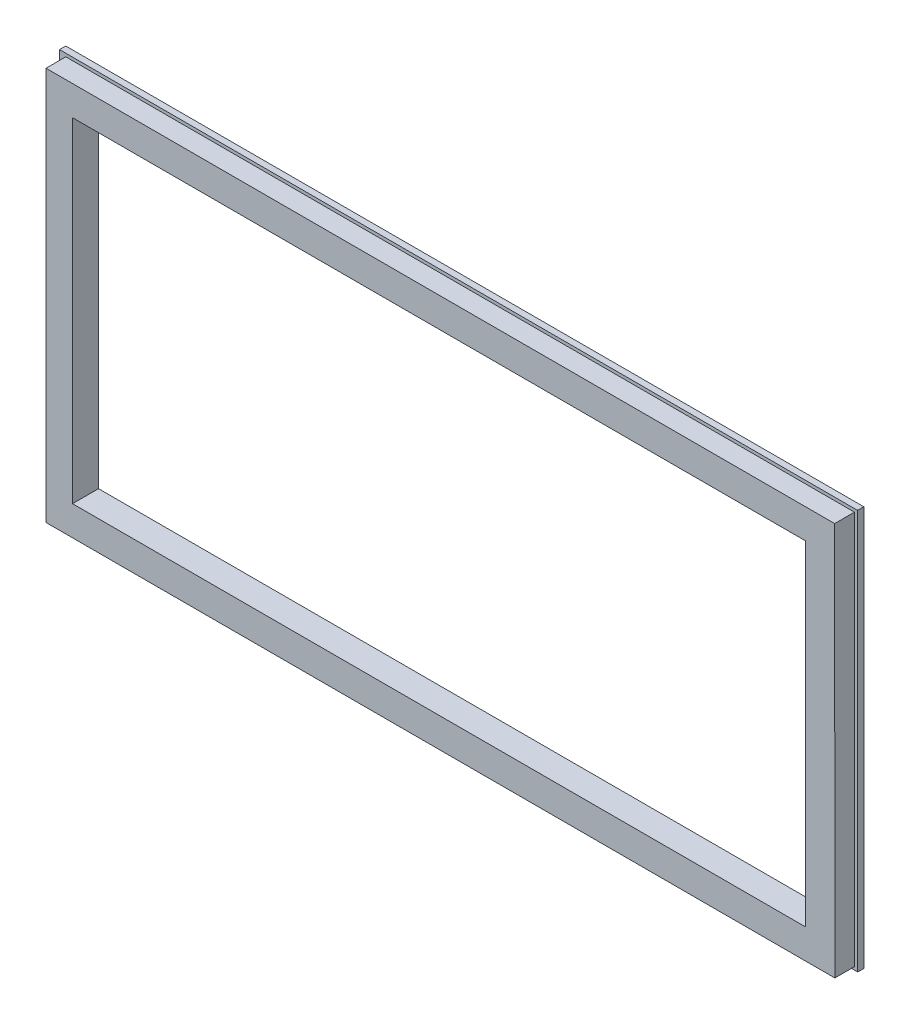
ISO-10303-21;
HEADER;
FILE_DESCRIPTION(('STEP AP214'),'2;1');
FILE_NAME('part.step','',(''),(''),'','','');
FILE_SCHEMA(('AUTOMOTIVE_DESIGN { 1 0 10303 214 1 1 1 1 }'));
ENDSEC;
DATA;
#1=APPLICATION_CONTEXT('core data for automotive mechanical design processes');
#2=APPLICATION_PROTOCOL_DEFINITION('international standard','automotive_design',2000,#1);
#3=PRODUCT_CONTEXT('',#1,'mechanical');
#4=PRODUCT('Part','Part','',(#3));
#5=PRODUCT_RELATED_PRODUCT_CATEGORY('part','',(#4));
#6=PRODUCT_DEFINITION_FORMATION('','',#4);
#7=PRODUCT_DEFINITION_CONTEXT('part definition',#1,'design');
#8=PRODUCT_DEFINITION('design','',#6,#7);
#9=PRODUCT_DEFINITION_SHAPE('','',#8);
#10=(LENGTH_UNIT() NAMED_UNIT(*) SI_UNIT(.MILLI.,.METRE.));
#11=(NAMED_UNIT(*) PLANE_ANGLE_UNIT() SI_UNIT($,.RADIAN.));
#12=(NAMED_UNIT(*) SI_UNIT($,.STERADIAN.) SOLID_ANGLE_UNIT());
#13=UNCERTAINTY_MEASURE_WITH_UNIT(LENGTH_MEASURE(1.E-05),#10,'distance_accuracy_value','');
#14=(GEOMETRIC_REPRESENTATION_CONTEXT(3) GLOBAL_UNCERTAINTY_ASSIGNED_CONTEXT((#13)) GLOBAL_UNIT_ASSIGNED_CONTEXT((#10,
#11,#12)) REPRESENTATION_CONTEXT('',''));
#15=CARTESIAN_POINT('',(0.,0.,0.));
#16=DIRECTION('',(0.,0.,1.));
#17=DIRECTION('',(1.,0.,0.));
#18=AXIS2_PLACEMENT_3D('',#15,#16,#17);
#19=CARTESIAN_POINT('',(-4.90493030607165,-7.72631975662474,3.));
#20=DIRECTION('',(0.99999998742194,0.000158606807848639,0.));
#21=DIRECTION('',(-0.000158606807848639,0.99999998742194,0.));
#22=AXIS2_PLACEMENT_3D('',#19,#20,#21);
#23=PLANE('',#22);
#24=DIRECTION('',(0.000158606807848639,-0.99999998742194,0.));
#25=VECTOR('',#24,1.);
#26=CARTESIAN_POINT('',(-4.90493030607165,-7.72631975662474,12.5));
#27=LINE('',#26,#25);
#28=CARTESIAN_POINT('',(-4.93514812619861,182.794,12.5));
#29=VERTEX_POINT('',#28);
#30=CARTESIAN_POINT('',(-4.90516811985873,-6.22692772347605,12.5));
#31=VERTEX_POINT('',#30);
#32=EDGE_CURVE('E210',#29,#31,#27,.T.);
#33=ORIENTED_EDGE('',*,*,#32,.F.);
#34=DIRECTION('',(0.,0.,1.));
#35=VECTOR('',#34,1.);
#36=CARTESIAN_POINT('',(-4.93514812619863,182.794,3.));
#37=LINE('',#36,#35);
#38=CARTESIAN_POINT('',(-4.93514812619861,182.794,3.));
#39=VERTEX_POINT('',#38);
#40=EDGE_CURVE('E245',#39,#29,#37,.T.);
#41=ORIENTED_EDGE('',*,*,#40,.F.);
#42=DIRECTION('',(-0.000158606807848639,0.99999998742194,0.));
#43=VECTOR('',#42,1.);
#44=CARTESIAN_POINT('',(-4.90493030607165,-7.72631975662474,3.));
#45=LINE('',#44,#43);
#46=CARTESIAN_POINT('',(-4.90516811985873,-6.22692772347605,3.));
#47=VERTEX_POINT('',#46);
#48=EDGE_CURVE('E249',#47,#39,#45,.T.);
#49=ORIENTED_EDGE('',*,*,#48,.F.);
#50=DIRECTION('',(0.,0.,-1.));
#51=VECTOR('',#50,1.);
#52=CARTESIAN_POINT('',(-4.90516811985873,-6.22692772347605,3.));
#53=LINE('',#52,#51);
#54=EDGE_CURVE('E242',#31,#47,#53,.T.);
#55=ORIENTED_EDGE('',*,*,#54,.F.);
#56=EDGE_LOOP('',(#33,#41,#49,#55));
#57=FACE_BOUND('',#56,.T.);
#58=ADVANCED_FACE('F64',(#57),#23,.F.);
#59=CARTESIAN_POINT('',(373.974431850337,182.794,3.));
#60=DIRECTION('',(0.,1.,0.));
#61=DIRECTION('',(0.,0.,1.));
#62=AXIS2_PLACEMENT_3D('',#59,#60,#61);
#63=PLANE('',#62);
#64=ORIENTED_EDGE('',*,*,#40,.T.);
#65=DIRECTION('',(-1.,0.,0.));
#66=VECTOR('',#65,1.);
#67=CARTESIAN_POINT('',(0.,182.794,12.5));
#68=LINE('',#67,#66);
#69=CARTESIAN_POINT('',(373.974431850337,182.794,12.5));
#70=VERTEX_POINT('',#69);
#71=EDGE_CURVE('E207',#70,#29,#68,.T.);
#72=ORIENTED_EDGE('',*,*,#71,.F.);
#73=DIRECTION('',(0.,0.,1.));
#74=VECTOR('',#73,1.);
#75=CARTESIAN_POINT('',(373.974431850337,182.794,3.));
#76=LINE('',#75,#74);
#77=CARTESIAN_POINT('',(373.974431850337,182.794,3.));
#78=VERTEX_POINT('',#77);
#79=EDGE_CURVE('E225',#78,#70,#76,.T.);
#80=ORIENTED_EDGE('',*,*,#79,.F.);
#81=DIRECTION('',(-1.,0.,0.));
#82=VECTOR('',#81,1.);
#83=CARTESIAN_POINT('',(373.974431850337,182.794,3.));
#84=LINE('',#83,#82);
#85=EDGE_CURVE('E213',#78,#39,#84,.T.);
#86=ORIENTED_EDGE('',*,*,#85,.T.);
#87=EDGE_LOOP('',(#64,#72,#80,#86));
#88=FACE_BOUND('',#87,.T.);
#89=ADVANCED_FACE('F311',(#88),#63,.T.);
#90=CARTESIAN_POINT('',(374.06527892994,-6.24362242789317,3.));
#91=DIRECTION('',(0.99999988452303,0.00048057665953073,0.));
#92=DIRECTION('',(-0.000480576659530731,0.999999884523031,0.));
#93=AXIS2_PLACEMENT_3D('',#90,#91,#92);
#94=PLANE('',#93);
#95=ORIENTED_EDGE('',*,*,#79,.T.);
#96=DIRECTION('',(-0.00048057665953073,0.999999884523031,0.));
#97=VECTOR('',#96,1.);
#98=CARTESIAN_POINT('',(374.062191999232,0.179765579446518,12.5));
#99=LINE('',#98,#97);
#100=CARTESIAN_POINT('',(374.06527892994,-6.24362242789317,12.5));
#101=VERTEX_POINT('',#100);
#102=EDGE_CURVE('E204',#101,#70,#99,.T.);
#103=ORIENTED_EDGE('',*,*,#102,.F.);
#104=DIRECTION('',(0.,0.,1.));
#105=VECTOR('',#104,1.);
#106=CARTESIAN_POINT('',(374.06527892994,-6.24362242789317,3.));
#107=LINE('',#106,#105);
#108=CARTESIAN_POINT('',(374.06527892994,-6.24362242789317,3.));
#109=VERTEX_POINT('',#108);
#110=EDGE_CURVE('E224',#109,#101,#107,.T.);
#111=ORIENTED_EDGE('',*,*,#110,.F.);
#112=DIRECTION('',(-0.00048057665953073,0.99999988452303,0.));
#113=VECTOR('',#112,1.);
#114=CARTESIAN_POINT('',(374.06527892994,-6.24362242789317,3.));
#115=LINE('',#114,#113);
#116=EDGE_CURVE('E220',#109,#78,#115,.T.);
#117=ORIENTED_EDGE('',*,*,#116,.T.);
#118=EDGE_LOOP('',(#95,#103,#111,#117));
#119=FACE_BOUND('',#118,.T.);
#120=ADVANCED_FACE('F307',(#119),#94,.T.);
#121=CARTESIAN_POINT('',(-6.40516814920643,-6.22686164429412,3.));
#122=DIRECTION('',(-4.4052787046825E-05,-0.999999999029676,0.));
#123=DIRECTION('',(0.999999999029676,-4.4052787046825E-05,0.));
#124=AXIS2_PLACEMENT_3D('',#121,#122,#123);
#125=PLANE('',#124);
#126=ORIENTED_EDGE('',*,*,#110,.T.);
#127=DIRECTION('',(0.999999999029676,-4.4052787046825E-05,0.));
#128=VECTOR('',#127,1.);
#129=CARTESIAN_POINT('',(-0.000274323039897018,-6.22714379771818,12.5));
#130=LINE('',#129,#128);
#131=EDGE_CURVE('E201',#31,#101,#130,.T.);
#132=ORIENTED_EDGE('',*,*,#131,.F.);
#133=ORIENTED_EDGE('',*,*,#54,.T.);
#134=DIRECTION('',(0.999999999029676,-4.4052787046825E-05,0.));
#135=VECTOR('',#134,1.);
#136=CARTESIAN_POINT('',(-6.40516814920643,-6.22686164429412,3.));
#137=LINE('',#136,#135);
#138=EDGE_CURVE('E217',#47,#109,#137,.T.);
#139=ORIENTED_EDGE('',*,*,#138,.T.);
#140=EDGE_LOOP('',(#126,#132,#133,#139));
#141=FACE_BOUND('',#140,.T.);
#142=ADVANCED_FACE('F302',(#141),#125,.T.);
#143=CARTESIAN_POINT('',(-0.000340402220467271,-7.72714379626269,16.));
#144=DIRECTION('',(-4.4052787046827E-05,-0.999999999029676,0.));
#145=DIRECTION('',(0.999999999029676,-4.4052787046827E-05,0.));
#146=AXIS2_PLACEMENT_3D('',#143,#144,#145);
#147=PLANE('',#146);
#148=DIRECTION('',(0.999999999029676,-4.4052787046825E-05,0.));
#149=VECTOR('',#148,1.);
#150=CARTESIAN_POINT('',(-6.405234228387,-7.72686164283864,3.));
#151=LINE('',#150,#149);
#152=CARTESIAN_POINT('',(-7.90493026833747,-7.72679557704829,3.));
#153=VERTEX_POINT('',#152);
#154=CARTESIAN_POINT('',(375.566,-7.74368854029444,3.));
#155=VERTEX_POINT('',#154);
#156=EDGE_CURVE('E235',#153,#155,#151,.T.);
#157=ORIENTED_EDGE('',*,*,#156,.F.);
#158=DIRECTION('',(0.,0.,-1.));
#159=VECTOR('',#158,1.);
#160=CARTESIAN_POINT('',(-7.90493026833747,-7.72679557704829,16.));
#161=LINE('',#160,#159);
#162=CARTESIAN_POINT('',(-7.90493026833747,-7.72679557704829,0.));
#163=VERTEX_POINT('',#162);
#164=EDGE_CURVE('E272',#153,#163,#161,.T.);
#165=ORIENTED_EDGE('',*,*,#164,.T.);
#166=DIRECTION('',(-0.999999999029676,4.4052787046827E-05,0.));
#167=VECTOR('',#166,1.);
#168=CARTESIAN_POINT('',(-0.000340402220467271,-7.72714379626269,0.));
#169=LINE('',#168,#167);
#170=CARTESIAN_POINT('',(375.566,-7.74368854029444,0.));
#171=VERTEX_POINT('',#170);
#172=EDGE_CURVE('E256',#171,#163,#169,.T.);
#173=ORIENTED_EDGE('',*,*,#172,.F.);
#174=DIRECTION('',(0.,0.,-1.));
#175=VECTOR('',#174,1.);
#176=CARTESIAN_POINT('',(375.566,-7.74368854029444,16.));
#177=LINE('',#176,#175);
#178=EDGE_CURVE('E12',#155,#171,#177,.T.);
#179=ORIENTED_EDGE('',*,*,#178,.F.);
#180=EDGE_LOOP('',(#157,#165,#173,#179));
#181=FACE_BOUND('',#180,.T.);
#182=ADVANCED_FACE('F66',(#181),#147,.T.);
#183=CARTESIAN_POINT('',(375.562191826016,0.180486444435868,16.));
#184=DIRECTION('',(0.99999988452303,0.000480576659530873,0.));
#185=DIRECTION('',(-0.000480576659530873,0.999999884523031,0.));
#186=AXIS2_PLACEMENT_3D('',#183,#184,#185);
#187=PLANE('',#186);
#188=DIRECTION('',(-0.00048057665953073,0.999999884523031,0.));
#189=VECTOR('',#188,1.);
#190=CARTESIAN_POINT('',(375.565278756724,-6.24290156290388,3.));
#191=LINE('',#190,#189);
#192=CARTESIAN_POINT('',(375.47371115848,184.294,3.));
#193=VERTEX_POINT('',#192);
#194=EDGE_CURVE('E238',#155,#193,#191,.T.);
#195=ORIENTED_EDGE('',*,*,#194,.F.);
#196=ORIENTED_EDGE('',*,*,#178,.T.);
#197=DIRECTION('',(0.000480576659530874,-0.999999884523031,0.));
#198=VECTOR('',#197,1.);
#199=CARTESIAN_POINT('',(375.562191826016,0.180486444435868,0.));
#200=LINE('',#199,#198);
#201=CARTESIAN_POINT('',(375.47371115848,184.294,0.));
#202=VERTEX_POINT('',#201);
#203=EDGE_CURVE('E260',#202,#171,#200,.T.);
#204=ORIENTED_EDGE('',*,*,#203,.F.);
#205=DIRECTION('',(0.,0.,-1.));
#206=VECTOR('',#205,1.);
#207=CARTESIAN_POINT('',(375.47371115848,184.294,16.));
#208=LINE('',#207,#206);
#209=EDGE_CURVE('E73',#193,#202,#208,.T.);
#210=ORIENTED_EDGE('',*,*,#209,.F.);
#211=EDGE_LOOP('',(#195,#196,#204,#210));
#212=FACE_BOUND('',#211,.T.);
#213=ADVANCED_FACE('F286',(#212),#187,.T.);
#214=CARTESIAN_POINT('',(0.,184.294,16.));
#215=DIRECTION('',(0.,1.,0.));
#216=DIRECTION('',(0.,0.,1.));
#217=AXIS2_PLACEMENT_3D('',#214,#215,#216);
#218=PLANE('',#217);
#219=DIRECTION('',(-1.,0.,0.));
#220=VECTOR('',#219,1.);
#221=CARTESIAN_POINT('',(0.,184.294,3.));
#222=LINE('',#221,#220);
#223=CARTESIAN_POINT('',(-7.93538607414757,184.294,3.));
#224=VERTEX_POINT('',#223);
#225=EDGE_CURVE('E253',#193,#224,#222,.T.);
#226=ORIENTED_EDGE('',*,*,#225,.F.);
#227=ORIENTED_EDGE('',*,*,#209,.T.);
#228=DIRECTION('',(1.,0.,0.));
#229=VECTOR('',#228,1.);
#230=CARTESIAN_POINT('',(0.,184.294,0.));
#231=LINE('',#230,#229);
#232=CARTESIAN_POINT('',(-7.93538607414757,184.294,0.));
#233=VERTEX_POINT('',#232);
#234=EDGE_CURVE('E264',#233,#202,#231,.T.);
#235=ORIENTED_EDGE('',*,*,#234,.F.);
#236=DIRECTION('',(0.,0.,-1.));
#237=VECTOR('',#236,1.);
#238=CARTESIAN_POINT('',(-7.93538607414757,184.294,16.));
#239=LINE('',#238,#237);
#240=EDGE_CURVE('E275',#224,#233,#239,.T.);
#241=ORIENTED_EDGE('',*,*,#240,.F.);
#242=EDGE_LOOP('',(#226,#227,#235,#241));
#243=FACE_BOUND('',#242,.T.);
#244=ADVANCED_FACE('F282',(#243),#218,.T.);
#245=CARTESIAN_POINT('',(-7.90615559184606,-0.00125397011654988,16.));
#246=DIRECTION('',(-0.99999998742194,-0.000158606807848639,0.));
#247=DIRECTION('',(0.000158606807848639,-0.99999998742194,0.));
#248=AXIS2_PLACEMENT_3D('',#245,#246,#247);
#249=PLANE('',#248);
#250=DIRECTION('',(0.00015860680784864,-0.99999998742194,0.));
#251=VECTOR('',#250,1.);
#252=CARTESIAN_POINT('',(-7.93514812619863,182.793762089788,3.));
#253=LINE('',#252,#251);
#254=EDGE_CURVE('E229',#224,#153,#253,.T.);
#255=ORIENTED_EDGE('',*,*,#254,.F.);
#256=ORIENTED_EDGE('',*,*,#240,.T.);
#257=DIRECTION('',(-0.000158606807848639,0.99999998742194,0.));
#258=VECTOR('',#257,1.);
#259=CARTESIAN_POINT('',(-7.90615559184606,-0.00125397011654988,0.));
#260=LINE('',#259,#258);
#261=EDGE_CURVE('E268',#163,#233,#260,.T.);
#262=ORIENTED_EDGE('',*,*,#261,.F.);
#263=ORIENTED_EDGE('',*,*,#164,.F.);
#264=EDGE_LOOP('',(#255,#256,#262,#263));
#265=FACE_BOUND('',#264,.T.);
#266=ADVANCED_FACE('F295',(#265),#249,.T.);
#267=CARTESIAN_POINT('',(0.,0.,0.));
#268=DIRECTION('',(0.,0.,1.));
#269=DIRECTION('',(1.,0.,0.));
#270=AXIS2_PLACEMENT_3D('',#267,#268,#269);
#271=PLANE('',#270);
#272=DIRECTION('',(1.86033702301786E-05,0.999999999826957,0.));
#273=VECTOR('',#272,1.);
#274=CARTESIAN_POINT('',(359.867371564663,-0.00669474594813714,0.));
#275=LINE('',#274,#273);
#276=CARTESIAN_POINT('',(359.86752,7.972254,0.));
#277=VERTEX_POINT('',#276);
#278=CARTESIAN_POINT('',(359.870508087205,168.593,0.));
#279=VERTEX_POINT('',#278);
#280=EDGE_CURVE('E193',#277,#279,#275,.T.);
#281=ORIENTED_EDGE('',*,*,#280,.T.);
#282=DIRECTION('',(-1.,0.,0.));
#283=VECTOR('',#282,1.);
#284=CARTESIAN_POINT('',(0.,168.593,0.));
#285=LINE('',#284,#283);
#286=CARTESIAN_POINT('',(7.78733508663618,168.593,0.));
#287=VERTEX_POINT('',#286);
#288=EDGE_CURVE('E197',#279,#287,#285,.T.);
#289=ORIENTED_EDGE('',*,*,#288,.T.);
#290=DIRECTION('',(4.52588693393582E-05,-0.999999998975817,0.));
#291=VECTOR('',#290,1.);
#292=CARTESIAN_POINT('',(7.79496539923558,0.000352791320870144,0.));
#293=LINE('',#292,#291);
#294=CARTESIAN_POINT('',(7.79460460000003,7.972254,0.));
#295=VERTEX_POINT('',#294);
#296=EDGE_CURVE('E184',#287,#295,#293,.T.);
#297=ORIENTED_EDGE('',*,*,#296,.T.);
#298=DIRECTION('',(1.,0.,0.));
#299=VECTOR('',#298,1.);
#300=CARTESIAN_POINT('',(0.,7.972254,0.));
#301=LINE('',#300,#299);
#302=EDGE_CURVE('E159',#295,#277,#301,.T.);
#303=ORIENTED_EDGE('',*,*,#302,.T.);
#304=EDGE_LOOP('',(#281,#289,#297,#303));
#305=FACE_BOUND('',#304,.T.);
#306=ORIENTED_EDGE('',*,*,#172,.T.);
#307=ORIENTED_EDGE('',*,*,#261,.T.);
#308=ORIENTED_EDGE('',*,*,#234,.T.);
#309=ORIENTED_EDGE('',*,*,#203,.T.);
#310=EDGE_LOOP('',(#306,#307,#308,#309));
#311=FACE_BOUND('',#310,.T.);
#312=ADVANCED_FACE('F290',(#305,#311),#271,.F.);
#313=CARTESIAN_POINT('',(0.,0.,3.));
#314=DIRECTION('',(0.,0.,-1.));
#315=DIRECTION('',(-1.,0.,0.));
#316=AXIS2_PLACEMENT_3D('',#313,#314,#315);
#317=PLANE('',#316);
#318=ORIENTED_EDGE('',*,*,#225,.T.);
#319=ORIENTED_EDGE('',*,*,#254,.T.);
#320=ORIENTED_EDGE('',*,*,#156,.T.);
#321=ORIENTED_EDGE('',*,*,#194,.T.);
#322=EDGE_LOOP('',(#318,#319,#320,#321));
#323=FACE_BOUND('',#322,.T.);
#324=ORIENTED_EDGE('',*,*,#48,.T.);
#325=ORIENTED_EDGE('',*,*,#85,.F.);
#326=ORIENTED_EDGE('',*,*,#116,.F.);
#327=ORIENTED_EDGE('',*,*,#138,.F.);
#328=EDGE_LOOP('',(#324,#325,#326,#327));
#329=FACE_BOUND('',#328,.T.);
#330=ADVANCED_FACE('F298',(#323,#329),#317,.F.);
#331=CARTESIAN_POINT('',(0.,0.,12.5));
#332=DIRECTION('',(0.,0.,1.));
#333=DIRECTION('',(1.,0.,0.));
#334=AXIS2_PLACEMENT_3D('',#331,#332,#333);
#335=PLANE('',#334);
#336=DIRECTION('',(-1.,0.,0.));
#337=VECTOR('',#336,1.);
#338=CARTESIAN_POINT('',(359.870508087205,168.593,12.5));
#339=LINE('',#338,#337);
#340=CARTESIAN_POINT('',(359.870508087205,168.593,12.5));
#341=VERTEX_POINT('',#340);
#342=CARTESIAN_POINT('',(7.78733508663618,168.593,12.5));
#343=VERTEX_POINT('',#342);
#344=EDGE_CURVE('E88',#341,#343,#339,.T.);
#345=ORIENTED_EDGE('',*,*,#344,.F.);
#346=DIRECTION('',(1.86033702301786E-05,0.999999999826957,0.));
#347=VECTOR('',#346,1.);
#348=CARTESIAN_POINT('',(359.86752,7.972254,12.5));
#349=LINE('',#348,#347);
#350=CARTESIAN_POINT('',(359.86752,7.972254,12.5));
#351=VERTEX_POINT('',#350);
#352=EDGE_CURVE('E174',#351,#341,#349,.T.);
#353=ORIENTED_EDGE('',*,*,#352,.F.);
#354=DIRECTION('',(1.,0.,0.));
#355=VECTOR('',#354,1.);
#356=CARTESIAN_POINT('',(7.79460460000003,7.972254,12.5));
#357=LINE('',#356,#355);
#358=CARTESIAN_POINT('',(7.79460460000003,7.972254,12.5));
#359=VERTEX_POINT('',#358);
#360=EDGE_CURVE('E156',#359,#351,#357,.T.);
#361=ORIENTED_EDGE('',*,*,#360,.F.);
#362=DIRECTION('',(4.52588693393582E-05,-0.999999998975817,0.));
#363=VECTOR('',#362,1.);
#364=CARTESIAN_POINT('',(7.78733508663618,168.593,12.5));
#365=LINE('',#364,#363);
#366=EDGE_CURVE('E166',#343,#359,#365,.T.);
#367=ORIENTED_EDGE('',*,*,#366,.F.);
#368=EDGE_LOOP('',(#345,#353,#361,#367));
#369=FACE_BOUND('',#368,.T.);
#370=ORIENTED_EDGE('',*,*,#32,.T.);
#371=ORIENTED_EDGE('',*,*,#131,.T.);
#372=ORIENTED_EDGE('',*,*,#102,.T.);
#373=ORIENTED_EDGE('',*,*,#71,.T.);
#374=EDGE_LOOP('',(#370,#371,#372,#373));
#375=FACE_BOUND('',#374,.T.);
#376=ADVANCED_FACE('F171',(#369,#375),#335,.T.);
#377=CARTESIAN_POINT('',(359.870508087205,168.593,-2.));
#378=DIRECTION('',(0.,1.,0.));
#379=DIRECTION('',(0.,0.,1.));
#380=AXIS2_PLACEMENT_3D('',#377,#378,#379);
#381=PLANE('',#380);
#382=DIRECTION('',(0.,0.,1.));
#383=VECTOR('',#382,1.);
#384=CARTESIAN_POINT('',(359.870508087205,168.593,-2.));
#385=LINE('',#384,#383);
#386=EDGE_CURVE('E181',#279,#341,#385,.T.);
#387=ORIENTED_EDGE('',*,*,#386,.T.);
#388=ORIENTED_EDGE('',*,*,#344,.T.);
#389=DIRECTION('',(0.,0.,1.));
#390=VECTOR('',#389,1.);
#391=CARTESIAN_POINT('',(7.78733508663618,168.593,-2.));
#392=LINE('',#391,#390);
#393=EDGE_CURVE('E163',#287,#343,#392,.T.);
#394=ORIENTED_EDGE('',*,*,#393,.F.);
#395=ORIENTED_EDGE('',*,*,#288,.F.);
#396=EDGE_LOOP('',(#387,#388,#394,#395));
#397=FACE_BOUND('',#396,.T.);
#398=ADVANCED_FACE('F355',(#397),#381,.F.);
#399=CARTESIAN_POINT('',(359.86752,7.972254,-2.));
#400=DIRECTION('',(0.999999999826957,-1.86033702301786E-05,0.));
#401=DIRECTION('',(1.86033702301786E-05,0.999999999826957,0.));
#402=AXIS2_PLACEMENT_3D('',#399,#400,#401);
#403=PLANE('',#402);
#404=DIRECTION('',(0.,0.,1.));
#405=VECTOR('',#404,1.);
#406=CARTESIAN_POINT('',(359.86752,7.972254,-2.));
#407=LINE('',#406,#405);
#408=EDGE_CURVE('E162',#277,#351,#407,.T.);
#409=ORIENTED_EDGE('',*,*,#408,.T.);
#410=ORIENTED_EDGE('',*,*,#352,.T.);
#411=ORIENTED_EDGE('',*,*,#386,.F.);
#412=ORIENTED_EDGE('',*,*,#280,.F.);
#413=EDGE_LOOP('',(#409,#410,#411,#412));
#414=FACE_BOUND('',#413,.T.);
#415=ADVANCED_FACE('F365',(#414),#403,.F.);
#416=CARTESIAN_POINT('',(7.79460460000003,7.972254,-2.));
#417=DIRECTION('',(0.,-1.,0.));
#418=DIRECTION('',(0.,0.,-1.));
#419=AXIS2_PLACEMENT_3D('',#416,#417,#418);
#420=PLANE('',#419);
#421=DIRECTION('',(0.,0.,1.));
#422=VECTOR('',#421,1.);
#423=CARTESIAN_POINT('',(7.79460460000003,7.972254,-2.));
#424=LINE('',#423,#422);
#425=EDGE_CURVE('E80',#295,#359,#424,.T.);
#426=ORIENTED_EDGE('',*,*,#425,.T.);
#427=ORIENTED_EDGE('',*,*,#360,.T.);
#428=ORIENTED_EDGE('',*,*,#408,.F.);
#429=ORIENTED_EDGE('',*,*,#302,.F.);
#430=EDGE_LOOP('',(#426,#427,#428,#429));
#431=FACE_BOUND('',#430,.T.);
#432=ADVANCED_FACE('F153',(#431),#420,.F.);
#433=CARTESIAN_POINT('',(7.78733508663618,168.593,-2.));
#434=DIRECTION('',(-0.999999998975817,-4.52588693393582E-05,0.));
#435=DIRECTION('',(4.52588693393582E-05,-0.999999998975817,0.));
#436=AXIS2_PLACEMENT_3D('',#433,#434,#435);
#437=PLANE('',#436);
#438=ORIENTED_EDGE('',*,*,#393,.T.);
#439=ORIENTED_EDGE('',*,*,#366,.T.);
#440=ORIENTED_EDGE('',*,*,#425,.F.);
#441=ORIENTED_EDGE('',*,*,#296,.F.);
#442=EDGE_LOOP('',(#438,#439,#440,#441));
#443=FACE_BOUND('',#442,.T.);
#444=ADVANCED_FACE('F167',(#443),#437,.F.);
#445=CLOSED_SHELL('',(#58,#89,#120,#142,#182,#213,#244,#266,#312,#330,#376,#398,#415,#432,#444));
#446=MANIFOLD_SOLID_BREP('B2',#445);
#447=ADVANCED_BREP_SHAPE_REPRESENTATION('',(#18,#446),#14);
#448=SHAPE_DEFINITION_REPRESENTATION(#9,#447);
ENDSEC;
END-ISO-10303-21;
